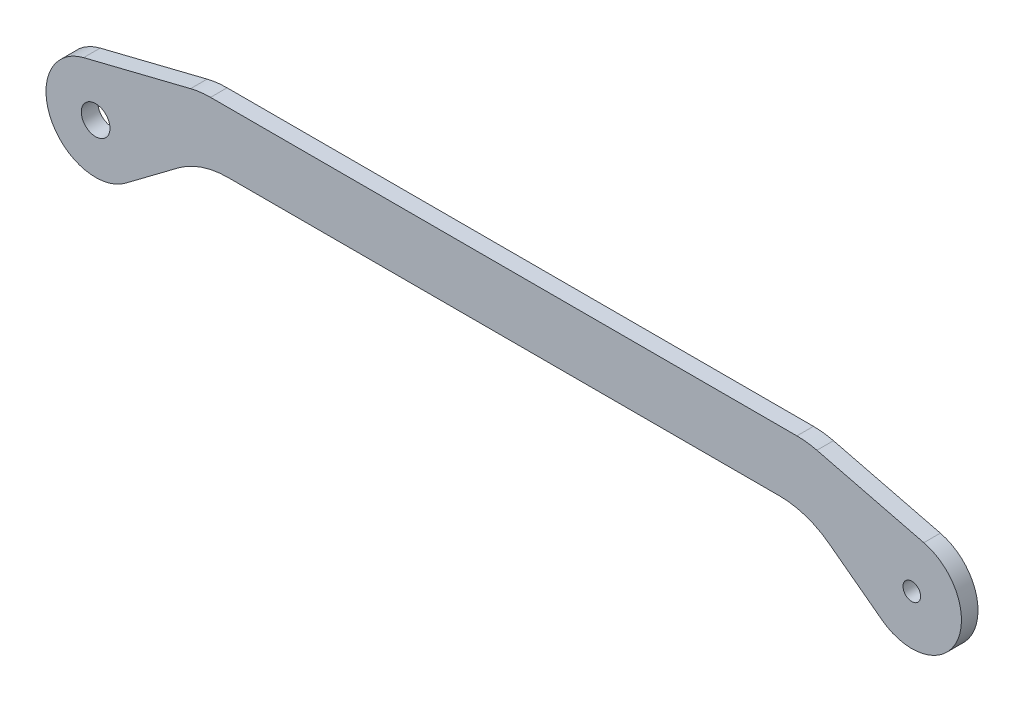
ISO-10303-21;
HEADER;
FILE_DESCRIPTION(('STEP AP214'),'2;1');
FILE_NAME('part.step','',(''),(''),'','','');
FILE_SCHEMA(('AUTOMOTIVE_DESIGN { 1 0 10303 214 1 1 1 1 }'));
ENDSEC;
DATA;
#1=APPLICATION_CONTEXT('core data for automotive mechanical design processes');
#2=APPLICATION_PROTOCOL_DEFINITION('international standard','automotive_design',2000,#1);
#3=PRODUCT_CONTEXT('',#1,'mechanical');
#4=PRODUCT('Part','Part','',(#3));
#5=PRODUCT_RELATED_PRODUCT_CATEGORY('part','',(#4));
#6=PRODUCT_DEFINITION_FORMATION('','',#4);
#7=PRODUCT_DEFINITION_CONTEXT('part definition',#1,'design');
#8=PRODUCT_DEFINITION('design','',#6,#7);
#9=PRODUCT_DEFINITION_SHAPE('','',#8);
#10=(LENGTH_UNIT() NAMED_UNIT(*) SI_UNIT(.MILLI.,.METRE.));
#11=(NAMED_UNIT(*) PLANE_ANGLE_UNIT() SI_UNIT($,.RADIAN.));
#12=(NAMED_UNIT(*) SI_UNIT($,.STERADIAN.) SOLID_ANGLE_UNIT());
#13=UNCERTAINTY_MEASURE_WITH_UNIT(LENGTH_MEASURE(1.E-05),#10,'distance_accuracy_value','');
#14=(GEOMETRIC_REPRESENTATION_CONTEXT(3) GLOBAL_UNCERTAINTY_ASSIGNED_CONTEXT((#13)) GLOBAL_UNIT_ASSIGNED_CONTEXT((#10,
#11,#12)) REPRESENTATION_CONTEXT('',''));
#15=CARTESIAN_POINT('',(0.,0.,0.));
#16=DIRECTION('',(0.,0.,1.));
#17=DIRECTION('',(1.,0.,0.));
#18=AXIS2_PLACEMENT_3D('',#15,#16,#17);
#19=CARTESIAN_POINT('',(-127.162549415693,-1.00000000000002,5.));
#20=DIRECTION('',(0.,0.,-1.));
#21=DIRECTION('',(-1.,0.,0.));
#22=AXIS2_PLACEMENT_3D('',#19,#20,#21);
#23=CYLINDRICAL_SURFACE('',#22,15.);
#24=CARTESIAN_POINT('',(-127.162549415693,-1.00000000000002,3.));
#25=DIRECTION('',(0.,0.,-1.));
#26=DIRECTION('',(-1.,0.,0.));
#27=AXIS2_PLACEMENT_3D('',#24,#25,#26);
#28=CIRCLE('',#27,15.);
#29=CARTESIAN_POINT('',(-127.162549415693,14.,3.));
#30=VERTEX_POINT('',#29);
#31=CARTESIAN_POINT('',(-130.783122284897,13.5564917510635,3.));
#32=VERTEX_POINT('',#31);
#33=EDGE_CURVE('E104',#30,#32,#28,.F.);
#34=ORIENTED_EDGE('',*,*,#33,.F.);
#35=DIRECTION('',(0.,0.,1.));
#36=VECTOR('',#35,1.);
#37=CARTESIAN_POINT('',(-127.162549415693,14.,5.));
#38=LINE('',#37,#36);
#39=CARTESIAN_POINT('',(-127.162549415693,14.,0.));
#40=VERTEX_POINT('',#39);
#41=EDGE_CURVE('E117',#30,#40,#38,.F.);
#42=ORIENTED_EDGE('',*,*,#41,.T.);
#43=CARTESIAN_POINT('',(-127.162549415693,-1.00000000000002,0.));
#44=DIRECTION('',(0.,0.,-1.));
#45=DIRECTION('',(-1.,0.,0.));
#46=AXIS2_PLACEMENT_3D('',#43,#44,#45);
#47=CIRCLE('',#46,15.);
#48=CARTESIAN_POINT('',(-130.783122284897,13.5564917510635,0.));
#49=VERTEX_POINT('',#48);
#50=EDGE_CURVE('E112',#40,#49,#47,.F.);
#51=ORIENTED_EDGE('',*,*,#50,.T.);
#52=DIRECTION('',(0.,0.,1.));
#53=VECTOR('',#52,1.);
#54=CARTESIAN_POINT('',(-130.783122284897,13.5564917510635,5.));
#55=LINE('',#54,#53);
#56=EDGE_CURVE('E93',#49,#32,#55,.T.);
#57=ORIENTED_EDGE('',*,*,#56,.T.);
#58=EDGE_LOOP('',(#34,#42,#51,#57));
#59=FACE_BOUND('',#58,.T.);
#60=ADVANCED_FACE('F33',(#59),#23,.T.);
#61=CARTESIAN_POINT('',(-150.172343721523,8.73389505063807,5.));
#62=DIRECTION('',(0.241371524613645,-0.970432783404232,0.));
#63=DIRECTION('',(0.970432783404232,0.241371524613645,0.));
#64=AXIS2_PLACEMENT_3D('',#61,#62,#63);
#65=PLANE('',#64);
#66=DIRECTION('',(0.,0.,-1.));
#67=VECTOR('',#66,1.);
#68=CARTESIAN_POINT('',(-150.172343721523,8.73389505063806,5.));
#69=LINE('',#68,#67);
#70=CARTESIAN_POINT('',(-150.172343721523,8.73389505063806,3.));
#71=VERTEX_POINT('',#70);
#72=CARTESIAN_POINT('',(-150.172343721523,8.73389505063807,0.));
#73=VERTEX_POINT('',#72);
#74=EDGE_CURVE('E103',#71,#73,#69,.T.);
#75=ORIENTED_EDGE('',*,*,#74,.F.);
#76=DIRECTION('',(0.970432783404232,0.241371524613645,0.));
#77=VECTOR('',#76,1.);
#78=CARTESIAN_POINT('',(-150.172343721523,8.73389505063807,3.));
#79=LINE('',#78,#77);
#80=EDGE_CURVE('E99',#71,#32,#79,.T.);
#81=ORIENTED_EDGE('',*,*,#80,.T.);
#82=ORIENTED_EDGE('',*,*,#56,.F.);
#83=DIRECTION('',(-0.970432783404232,-0.241371524613645,0.));
#84=VECTOR('',#83,1.);
#85=CARTESIAN_POINT('',(-130.783122284897,13.5564917510635,0.));
#86=LINE('',#85,#84);
#87=EDGE_CURVE('E97',#49,#73,#86,.T.);
#88=ORIENTED_EDGE('',*,*,#87,.T.);
#89=EDGE_LOOP('',(#75,#81,#82,#88));
#90=FACE_BOUND('',#89,.T.);
#91=ADVANCED_FACE('F96',(#90),#65,.F.);
#92=CARTESIAN_POINT('',(-148.,0.,5.));
#93=DIRECTION('',(0.,0.,-1.));
#94=DIRECTION('',(-1.,0.,0.));
#95=AXIS2_PLACEMENT_3D('',#92,#93,#94);
#96=CYLINDRICAL_SURFACE('',#95,8.99999999999998);
#97=CARTESIAN_POINT('',(-148.,0.,3.));
#98=DIRECTION('',(0.,0.,-1.));
#99=DIRECTION('',(-1.,0.,0.));
#100=AXIS2_PLACEMENT_3D('',#97,#98,#99);
#101=CIRCLE('',#100,8.99999999999998);
#102=CARTESIAN_POINT('',(-142.6,-7.20000000000001,3.));
#103=VERTEX_POINT('',#102);
#104=EDGE_CURVE('E173',#71,#103,#101,.F.);
#105=ORIENTED_EDGE('',*,*,#104,.F.);
#106=ORIENTED_EDGE('',*,*,#74,.T.);
#107=CARTESIAN_POINT('',(-148.,0.,0.));
#108=DIRECTION('',(0.,0.,-1.));
#109=DIRECTION('',(-1.,0.,0.));
#110=AXIS2_PLACEMENT_3D('',#107,#108,#109);
#111=CIRCLE('',#110,8.99999999999998);
#112=CARTESIAN_POINT('',(-142.6,-7.2,0.));
#113=VERTEX_POINT('',#112);
#114=EDGE_CURVE('E114',#73,#113,#111,.F.);
#115=ORIENTED_EDGE('',*,*,#114,.T.);
#116=DIRECTION('',(0.,0.,1.));
#117=VECTOR('',#116,1.);
#118=CARTESIAN_POINT('',(-142.6,-7.20000000000001,5.));
#119=LINE('',#118,#117);
#120=EDGE_CURVE('E138',#113,#103,#119,.T.);
#121=ORIENTED_EDGE('',*,*,#120,.T.);
#122=EDGE_LOOP('',(#105,#106,#115,#121));
#123=FACE_BOUND('',#122,.T.);
#124=ADVANCED_FACE('F236',(#123),#96,.T.);
#125=CARTESIAN_POINT('',(-142.6,-7.20000000000001,5.));
#126=DIRECTION('',(-0.6,0.8,0.));
#127=DIRECTION('',(-0.8,-0.6,0.));
#128=AXIS2_PLACEMENT_3D('',#125,#126,#127);
#129=PLANE('',#128);
#130=DIRECTION('',(0.,0.,1.));
#131=VECTOR('',#130,1.);
#132=CARTESIAN_POINT('',(-133.,0.,5.));
#133=LINE('',#132,#131);
#134=CARTESIAN_POINT('',(-133.,0.,0.));
#135=VERTEX_POINT('',#134);
#136=CARTESIAN_POINT('',(-133.,0.,3.));
#137=VERTEX_POINT('',#136);
#138=EDGE_CURVE('E141',#135,#137,#133,.T.);
#139=ORIENTED_EDGE('',*,*,#138,.T.);
#140=DIRECTION('',(-0.8,-0.6,0.));
#141=VECTOR('',#140,1.);
#142=CARTESIAN_POINT('',(-142.6,-7.20000000000001,3.));
#143=LINE('',#142,#141);
#144=EDGE_CURVE('E176',#137,#103,#143,.T.);
#145=ORIENTED_EDGE('',*,*,#144,.T.);
#146=ORIENTED_EDGE('',*,*,#120,.F.);
#147=DIRECTION('',(0.800000000000001,0.599999999999999,0.));
#148=VECTOR('',#147,1.);
#149=CARTESIAN_POINT('',(-142.6,-7.2,0.));
#150=LINE('',#149,#148);
#151=EDGE_CURVE('E121',#113,#135,#150,.T.);
#152=ORIENTED_EDGE('',*,*,#151,.T.);
#153=EDGE_LOOP('',(#139,#145,#146,#152));
#154=FACE_BOUND('',#153,.T.);
#155=ADVANCED_FACE('F240',(#154),#129,.F.);
#156=CARTESIAN_POINT('',(-124.,-12.,5.));
#157=DIRECTION('',(0.,0.,1.));
#158=DIRECTION('',(1.,0.,0.));
#159=AXIS2_PLACEMENT_3D('',#156,#157,#158);
#160=CYLINDRICAL_SURFACE('',#159,15.);
#161=DIRECTION('',(0.,0.,1.));
#162=VECTOR('',#161,1.);
#163=CARTESIAN_POINT('',(-124.,2.99999999999998,5.));
#164=LINE('',#163,#162);
#165=CARTESIAN_POINT('',(-124.,2.99999999999998,0.));
#166=VERTEX_POINT('',#165);
#167=CARTESIAN_POINT('',(-124.,2.99999999999998,3.));
#168=VERTEX_POINT('',#167);
#169=EDGE_CURVE('E144',#166,#168,#164,.T.);
#170=ORIENTED_EDGE('',*,*,#169,.T.);
#171=CARTESIAN_POINT('',(-124.,-12.,3.));
#172=DIRECTION('',(0.,0.,-1.));
#173=DIRECTION('',(-1.,0.,0.));
#174=AXIS2_PLACEMENT_3D('',#171,#172,#173);
#175=CIRCLE('',#174,15.);
#176=EDGE_CURVE('E179',#168,#137,#175,.F.);
#177=ORIENTED_EDGE('',*,*,#176,.T.);
#178=ORIENTED_EDGE('',*,*,#138,.F.);
#179=CARTESIAN_POINT('',(-124.,-12.,0.));
#180=DIRECTION('',(0.,0.,1.));
#181=DIRECTION('',(1.,0.,0.));
#182=AXIS2_PLACEMENT_3D('',#179,#180,#181);
#183=CIRCLE('',#182,15.);
#184=EDGE_CURVE('E122',#135,#166,#183,.F.);
#185=ORIENTED_EDGE('',*,*,#184,.T.);
#186=EDGE_LOOP('',(#170,#177,#178,#185));
#187=FACE_BOUND('',#186,.T.);
#188=ADVANCED_FACE('F246',(#187),#160,.F.);
#189=CARTESIAN_POINT('',(-129.,2.99999999999998,5.));
#190=DIRECTION('',(0.,1.,0.));
#191=DIRECTION('',(0.,0.,1.));
#192=AXIS2_PLACEMENT_3D('',#189,#190,#191);
#193=PLANE('',#192);
#194=DIRECTION('',(0.,0.,1.));
#195=VECTOR('',#194,1.);
#196=CARTESIAN_POINT('',(-24.,2.99999999999999,5.));
#197=LINE('',#196,#195);
#198=CARTESIAN_POINT('',(-24.,2.99999999999999,0.));
#199=VERTEX_POINT('',#198);
#200=CARTESIAN_POINT('',(-24.,2.99999999999999,3.));
#201=VERTEX_POINT('',#200);
#202=EDGE_CURVE('E147',#199,#201,#197,.T.);
#203=ORIENTED_EDGE('',*,*,#202,.T.);
#204=DIRECTION('',(-1.,0.,0.));
#205=VECTOR('',#204,1.);
#206=CARTESIAN_POINT('',(-129.,2.99999999999998,3.));
#207=LINE('',#206,#205);
#208=EDGE_CURVE('E182',#201,#168,#207,.T.);
#209=ORIENTED_EDGE('',*,*,#208,.T.);
#210=ORIENTED_EDGE('',*,*,#169,.F.);
#211=DIRECTION('',(1.,0.,0.));
#212=VECTOR('',#211,1.);
#213=CARTESIAN_POINT('',(0.,2.99999999999998,0.));
#214=LINE('',#213,#212);
#215=EDGE_CURVE('E125',#166,#199,#214,.T.);
#216=ORIENTED_EDGE('',*,*,#215,.T.);
#217=EDGE_LOOP('',(#203,#209,#210,#216));
#218=FACE_BOUND('',#217,.T.);
#219=ADVANCED_FACE('F250',(#218),#193,.F.);
#220=CARTESIAN_POINT('',(-24.,-12.,5.));
#221=DIRECTION('',(0.,0.,1.));
#222=DIRECTION('',(1.,0.,0.));
#223=AXIS2_PLACEMENT_3D('',#220,#221,#222);
#224=CYLINDRICAL_SURFACE('',#223,15.);
#225=DIRECTION('',(0.,0.,1.));
#226=VECTOR('',#225,1.);
#227=CARTESIAN_POINT('',(-15.,0.,5.));
#228=LINE('',#227,#226);
#229=CARTESIAN_POINT('',(-15.,0.,0.));
#230=VERTEX_POINT('',#229);
#231=CARTESIAN_POINT('',(-15.,0.,3.));
#232=VERTEX_POINT('',#231);
#233=EDGE_CURVE('E150',#230,#232,#228,.T.);
#234=ORIENTED_EDGE('',*,*,#233,.T.);
#235=CARTESIAN_POINT('',(-24.,-12.,3.));
#236=DIRECTION('',(0.,0.,-1.));
#237=DIRECTION('',(-1.,0.,0.));
#238=AXIS2_PLACEMENT_3D('',#235,#236,#237);
#239=CIRCLE('',#238,15.);
#240=EDGE_CURVE('E185',#232,#201,#239,.F.);
#241=ORIENTED_EDGE('',*,*,#240,.T.);
#242=ORIENTED_EDGE('',*,*,#202,.F.);
#243=CARTESIAN_POINT('',(-24.,-12.,0.));
#244=DIRECTION('',(0.,0.,1.));
#245=DIRECTION('',(1.,0.,0.));
#246=AXIS2_PLACEMENT_3D('',#243,#244,#245);
#247=CIRCLE('',#246,15.);
#248=EDGE_CURVE('E126',#199,#230,#247,.F.);
#249=ORIENTED_EDGE('',*,*,#248,.T.);
#250=EDGE_LOOP('',(#234,#241,#242,#249));
#251=FACE_BOUND('',#250,.T.);
#252=ADVANCED_FACE('F254',(#251),#224,.F.);
#253=CARTESIAN_POINT('',(-19.,2.99999999999998,5.));
#254=DIRECTION('',(0.599999999999999,0.800000000000001,0.));
#255=DIRECTION('',(-0.800000000000001,0.599999999999999,0.));
#256=AXIS2_PLACEMENT_3D('',#253,#254,#255);
#257=PLANE('',#256);
#258=DIRECTION('',(0.,0.,-1.));
#259=VECTOR('',#258,1.);
#260=CARTESIAN_POINT('',(-5.39999999999999,-7.20000000000001,5.));
#261=LINE('',#260,#259);
#262=CARTESIAN_POINT('',(-5.39999999999999,-7.20000000000001,3.));
#263=VERTEX_POINT('',#262);
#264=CARTESIAN_POINT('',(-5.39999999999999,-7.20000000000001,0.));
#265=VERTEX_POINT('',#264);
#266=EDGE_CURVE('E153',#263,#265,#261,.T.);
#267=ORIENTED_EDGE('',*,*,#266,.F.);
#268=DIRECTION('',(-0.800000000000001,0.599999999999999,0.));
#269=VECTOR('',#268,1.);
#270=CARTESIAN_POINT('',(-19.,2.99999999999998,3.));
#271=LINE('',#270,#269);
#272=EDGE_CURVE('E188',#263,#232,#271,.T.);
#273=ORIENTED_EDGE('',*,*,#272,.T.);
#274=ORIENTED_EDGE('',*,*,#233,.F.);
#275=DIRECTION('',(0.800000000000001,-0.599999999999999,0.));
#276=VECTOR('',#275,1.);
#277=CARTESIAN_POINT('',(-15.,0.,0.));
#278=LINE('',#277,#276);
#279=EDGE_CURVE('E129',#230,#265,#278,.T.);
#280=ORIENTED_EDGE('',*,*,#279,.T.);
#281=EDGE_LOOP('',(#267,#273,#274,#280));
#282=FACE_BOUND('',#281,.T.);
#283=ADVANCED_FACE('F258',(#282),#257,.F.);
#284=CARTESIAN_POINT('',(0.,0.,5.));
#285=DIRECTION('',(0.,0.,-1.));
#286=DIRECTION('',(-1.,0.,0.));
#287=AXIS2_PLACEMENT_3D('',#284,#285,#286);
#288=CYLINDRICAL_SURFACE('',#287,9.);
#289=CARTESIAN_POINT('',(0.,0.,3.));
#290=DIRECTION('',(0.,0.,-1.));
#291=DIRECTION('',(-1.,0.,0.));
#292=AXIS2_PLACEMENT_3D('',#289,#290,#291);
#293=CIRCLE('',#292,9.);
#294=CARTESIAN_POINT('',(2.17234372152279,8.73389505063809,3.));
#295=VERTEX_POINT('',#294);
#296=EDGE_CURVE('E191',#263,#295,#293,.F.);
#297=ORIENTED_EDGE('',*,*,#296,.F.);
#298=ORIENTED_EDGE('',*,*,#266,.T.);
#299=CARTESIAN_POINT('',(0.,0.,0.));
#300=DIRECTION('',(0.,0.,-1.));
#301=DIRECTION('',(-1.,0.,0.));
#302=AXIS2_PLACEMENT_3D('',#299,#300,#301);
#303=CIRCLE('',#302,9.);
#304=CARTESIAN_POINT('',(2.17234372152279,8.73389505063809,0.));
#305=VERTEX_POINT('',#304);
#306=EDGE_CURVE('E130',#265,#305,#303,.F.);
#307=ORIENTED_EDGE('',*,*,#306,.T.);
#308=DIRECTION('',(0.,0.,1.));
#309=VECTOR('',#308,1.);
#310=CARTESIAN_POINT('',(2.1723437215228,8.73389505063809,5.));
#311=LINE('',#310,#309);
#312=EDGE_CURVE('E155',#305,#295,#311,.T.);
#313=ORIENTED_EDGE('',*,*,#312,.T.);
#314=EDGE_LOOP('',(#297,#298,#307,#313));
#315=FACE_BOUND('',#314,.T.);
#316=ADVANCED_FACE('F262',(#315),#288,.T.);
#317=CARTESIAN_POINT('',(-19.,14.,5.));
#318=DIRECTION('',(-0.241371524613644,-0.970432783404232,0.));
#319=DIRECTION('',(0.970432783404232,-0.241371524613644,0.));
#320=AXIS2_PLACEMENT_3D('',#317,#318,#319);
#321=PLANE('',#320);
#322=DIRECTION('',(0.,0.,-1.));
#323=VECTOR('',#322,1.);
#324=CARTESIAN_POINT('',(-17.2168777151028,13.5564917510635,5.));
#325=LINE('',#324,#323);
#326=CARTESIAN_POINT('',(-17.2168777151028,13.5564917510635,3.));
#327=VERTEX_POINT('',#326);
#328=CARTESIAN_POINT('',(-17.2168777151028,13.5564917510635,0.));
#329=VERTEX_POINT('',#328);
#330=EDGE_CURVE('E158',#327,#329,#325,.T.);
#331=ORIENTED_EDGE('',*,*,#330,.F.);
#332=DIRECTION('',(0.970432783404232,-0.241371524613644,0.));
#333=VECTOR('',#332,1.);
#334=CARTESIAN_POINT('',(-19.,14.,3.));
#335=LINE('',#334,#333);
#336=EDGE_CURVE('E194',#327,#295,#335,.T.);
#337=ORIENTED_EDGE('',*,*,#336,.T.);
#338=ORIENTED_EDGE('',*,*,#312,.F.);
#339=DIRECTION('',(-0.970432783404232,0.241371524613644,0.));
#340=VECTOR('',#339,1.);
#341=CARTESIAN_POINT('',(2.17234372152279,8.73389505063809,0.));
#342=LINE('',#341,#340);
#343=EDGE_CURVE('E133',#305,#329,#342,.T.);
#344=ORIENTED_EDGE('',*,*,#343,.T.);
#345=EDGE_LOOP('',(#331,#337,#338,#344));
#346=FACE_BOUND('',#345,.T.);
#347=ADVANCED_FACE('F266',(#346),#321,.F.);
#348=CARTESIAN_POINT('',(-20.8374505843074,-1.00000000000002,5.));
#349=DIRECTION('',(0.,0.,-1.));
#350=DIRECTION('',(-1.,0.,0.));
#351=AXIS2_PLACEMENT_3D('',#348,#349,#350);
#352=CYLINDRICAL_SURFACE('',#351,15.);
#353=CARTESIAN_POINT('',(-20.8374505843074,-1.00000000000002,3.));
#354=DIRECTION('',(0.,0.,-1.));
#355=DIRECTION('',(-1.,0.,0.));
#356=AXIS2_PLACEMENT_3D('',#353,#354,#355);
#357=CIRCLE('',#356,15.);
#358=CARTESIAN_POINT('',(-20.8374505843074,14.,3.));
#359=VERTEX_POINT('',#358);
#360=EDGE_CURVE('E47',#327,#359,#357,.F.);
#361=ORIENTED_EDGE('',*,*,#360,.F.);
#362=ORIENTED_EDGE('',*,*,#330,.T.);
#363=CARTESIAN_POINT('',(-20.8374505843074,-1.00000000000002,0.));
#364=DIRECTION('',(0.,0.,-1.));
#365=DIRECTION('',(-1.,0.,0.));
#366=AXIS2_PLACEMENT_3D('',#363,#364,#365);
#367=CIRCLE('',#366,15.);
#368=CARTESIAN_POINT('',(-20.8374505843074,14.,0.));
#369=VERTEX_POINT('',#368);
#370=EDGE_CURVE('E134',#329,#369,#367,.F.);
#371=ORIENTED_EDGE('',*,*,#370,.T.);
#372=DIRECTION('',(0.,0.,1.));
#373=VECTOR('',#372,1.);
#374=CARTESIAN_POINT('',(-20.8374505843074,14.,5.));
#375=LINE('',#374,#373);
#376=EDGE_CURVE('E54',#369,#359,#375,.T.);
#377=ORIENTED_EDGE('',*,*,#376,.T.);
#378=EDGE_LOOP('',(#361,#362,#371,#377));
#379=FACE_BOUND('',#378,.T.);
#380=ADVANCED_FACE('F270',(#379),#352,.T.);
#381=CARTESIAN_POINT('',(-129.,14.,5.));
#382=DIRECTION('',(0.,-1.,0.));
#383=DIRECTION('',(1.,0.,0.));
#384=AXIS2_PLACEMENT_3D('',#381,#382,#383);
#385=PLANE('',#384);
#386=ORIENTED_EDGE('',*,*,#41,.F.);
#387=DIRECTION('',(1.,0.,0.));
#388=VECTOR('',#387,1.);
#389=CARTESIAN_POINT('',(-129.,14.,3.));
#390=LINE('',#389,#388);
#391=EDGE_CURVE('E11',#30,#359,#390,.T.);
#392=ORIENTED_EDGE('',*,*,#391,.T.);
#393=ORIENTED_EDGE('',*,*,#376,.F.);
#394=DIRECTION('',(1.,0.,0.));
#395=VECTOR('',#394,1.);
#396=CARTESIAN_POINT('',(0.,14.,0.));
#397=LINE('',#396,#395);
#398=EDGE_CURVE('E40',#369,#40,#397,.F.);
#399=ORIENTED_EDGE('',*,*,#398,.T.);
#400=EDGE_LOOP('',(#386,#392,#393,#399));
#401=FACE_BOUND('',#400,.T.);
#402=ADVANCED_FACE('F228',(#401),#385,.F.);
#403=CARTESIAN_POINT('',(0.,0.,0.));
#404=DIRECTION('',(0.,0.,1.));
#405=DIRECTION('',(1.,0.,0.));
#406=AXIS2_PLACEMENT_3D('',#403,#404,#405);
#407=PLANE('',#406);
#408=ORIENTED_EDGE('',*,*,#343,.F.);
#409=ORIENTED_EDGE('',*,*,#306,.F.);
#410=ORIENTED_EDGE('',*,*,#279,.F.);
#411=ORIENTED_EDGE('',*,*,#248,.F.);
#412=ORIENTED_EDGE('',*,*,#215,.F.);
#413=ORIENTED_EDGE('',*,*,#184,.F.);
#414=ORIENTED_EDGE('',*,*,#151,.F.);
#415=ORIENTED_EDGE('',*,*,#114,.F.);
#416=ORIENTED_EDGE('',*,*,#87,.F.);
#417=ORIENTED_EDGE('',*,*,#50,.F.);
#418=ORIENTED_EDGE('',*,*,#398,.F.);
#419=ORIENTED_EDGE('',*,*,#370,.F.);
#420=EDGE_LOOP('',(#408,#409,#410,#411,#412,#413,#414,#415,#416,#417,#418,#419));
#421=FACE_BOUND('',#420,.T.);
#422=CARTESIAN_POINT('',(-148.,0.,0.));
#423=DIRECTION('',(0.,0.,1.));
#424=DIRECTION('',(1.,0.,0.));
#425=AXIS2_PLACEMENT_3D('',#422,#423,#424);
#426=CIRCLE('',#425,2.59999999999999);
#427=CARTESIAN_POINT('',(-145.4,0.,0.));
#428=VERTEX_POINT('',#427);
#429=EDGE_CURVE('E198',#428,#428,#426,.T.);
#430=ORIENTED_EDGE('',*,*,#429,.T.);
#431=EDGE_LOOP('',(#430));
#432=FACE_BOUND('',#431,.T.);
#433=CARTESIAN_POINT('',(0.,0.,0.));
#434=DIRECTION('',(0.,0.,1.));
#435=DIRECTION('',(1.,0.,0.));
#436=AXIS2_PLACEMENT_3D('',#433,#434,#435);
#437=CIRCLE('',#436,1.6);
#438=CARTESIAN_POINT('',(1.6,0.,0.));
#439=VERTEX_POINT('',#438);
#440=EDGE_CURVE('E202',#439,#439,#437,.T.);
#441=ORIENTED_EDGE('',*,*,#440,.T.);
#442=EDGE_LOOP('',(#441));
#443=FACE_BOUND('',#442,.T.);
#444=ADVANCED_FACE('F110',(#421,#432,#443),#407,.F.);
#445=CARTESIAN_POINT('',(0.,0.,3.));
#446=DIRECTION('',(0.,0.,-1.));
#447=DIRECTION('',(-1.,0.,0.));
#448=AXIS2_PLACEMENT_3D('',#445,#446,#447);
#449=PLANE('',#448);
#450=ORIENTED_EDGE('',*,*,#272,.F.);
#451=ORIENTED_EDGE('',*,*,#296,.T.);
#452=ORIENTED_EDGE('',*,*,#336,.F.);
#453=ORIENTED_EDGE('',*,*,#360,.T.);
#454=ORIENTED_EDGE('',*,*,#391,.F.);
#455=ORIENTED_EDGE('',*,*,#33,.T.);
#456=ORIENTED_EDGE('',*,*,#80,.F.);
#457=ORIENTED_EDGE('',*,*,#104,.T.);
#458=ORIENTED_EDGE('',*,*,#144,.F.);
#459=ORIENTED_EDGE('',*,*,#176,.F.);
#460=ORIENTED_EDGE('',*,*,#208,.F.);
#461=ORIENTED_EDGE('',*,*,#240,.F.);
#462=EDGE_LOOP('',(#450,#451,#452,#453,#454,#455,#456,#457,#458,#459,#460,#461));
#463=FACE_BOUND('',#462,.T.);
#464=CARTESIAN_POINT('',(-148.,0.,3.));
#465=DIRECTION('',(0.,0.,1.));
#466=DIRECTION('',(1.,0.,0.));
#467=AXIS2_PLACEMENT_3D('',#464,#465,#466);
#468=CIRCLE('',#467,2.59999999999999);
#469=CARTESIAN_POINT('',(-145.4,0.,3.));
#470=VERTEX_POINT('',#469);
#471=EDGE_CURVE('E199',#470,#470,#468,.T.);
#472=ORIENTED_EDGE('',*,*,#471,.F.);
#473=EDGE_LOOP('',(#472));
#474=FACE_BOUND('',#473,.T.);
#475=CARTESIAN_POINT('',(0.,0.,3.));
#476=DIRECTION('',(0.,0.,1.));
#477=DIRECTION('',(1.,0.,0.));
#478=AXIS2_PLACEMENT_3D('',#475,#476,#477);
#479=CIRCLE('',#478,1.6);
#480=CARTESIAN_POINT('',(1.6,0.,3.));
#481=VERTEX_POINT('',#480);
#482=EDGE_CURVE('E205',#481,#481,#479,.T.);
#483=ORIENTED_EDGE('',*,*,#482,.F.);
#484=EDGE_LOOP('',(#483));
#485=FACE_BOUND('',#484,.T.);
#486=ADVANCED_FACE('F219',(#463,#474,#485),#449,.F.);
#487=CARTESIAN_POINT('',(-148.,0.,0.));
#488=DIRECTION('',(0.,0.,1.));
#489=DIRECTION('',(1.,0.,0.));
#490=AXIS2_PLACEMENT_3D('',#487,#488,#489);
#491=CYLINDRICAL_SURFACE('',#490,2.59999999999999);
#492=ORIENTED_EDGE('',*,*,#429,.F.);
#493=EDGE_LOOP('',(#492));
#494=FACE_BOUND('',#493,.T.);
#495=ORIENTED_EDGE('',*,*,#471,.T.);
#496=EDGE_LOOP('',(#495));
#497=FACE_BOUND('',#496,.T.);
#498=ADVANCED_FACE('F215',(#494,#497),#491,.F.);
#499=CARTESIAN_POINT('',(0.,0.,0.));
#500=DIRECTION('',(0.,0.,1.));
#501=DIRECTION('',(1.,0.,0.));
#502=AXIS2_PLACEMENT_3D('',#499,#500,#501);
#503=CYLINDRICAL_SURFACE('',#502,1.6);
#504=ORIENTED_EDGE('',*,*,#440,.F.);
#505=EDGE_LOOP('',(#504));
#506=FACE_BOUND('',#505,.T.);
#507=ORIENTED_EDGE('',*,*,#482,.T.);
#508=EDGE_LOOP('',(#507));
#509=FACE_BOUND('',#508,.T.);
#510=ADVANCED_FACE('F212',(#506,#509),#503,.F.);
#511=CLOSED_SHELL('',(#60,#91,#124,#155,#188,#219,#252,#283,#316,#347,#380,#402,#444,#486,#498,#510));
#512=MANIFOLD_SOLID_BREP('B2',#511);
#513=ADVANCED_BREP_SHAPE_REPRESENTATION('',(#18,#512),#14);
#514=SHAPE_DEFINITION_REPRESENTATION(#9,#513);
ENDSEC;
END-ISO-10303-21;
